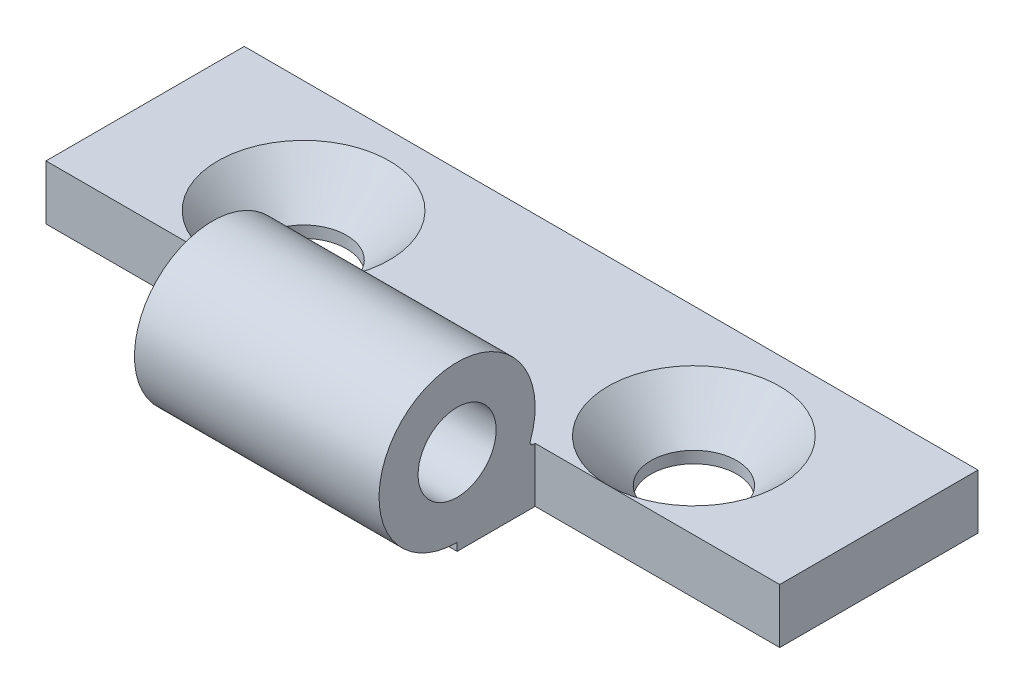
ISO-10303-21;
HEADER;
FILE_DESCRIPTION(('STEP AP214'),'2;1');
FILE_NAME('part.step','',(''),(''),'','','');
FILE_SCHEMA(('AUTOMOTIVE_DESIGN { 1 0 10303 214 1 1 1 1 }'));
ENDSEC;
DATA;
#1=APPLICATION_CONTEXT('core data for automotive mechanical design processes');
#2=APPLICATION_PROTOCOL_DEFINITION('international standard','automotive_design',2000,#1);
#3=PRODUCT_CONTEXT('',#1,'mechanical');
#4=PRODUCT('Part','Part','',(#3));
#5=PRODUCT_RELATED_PRODUCT_CATEGORY('part','',(#4));
#6=PRODUCT_DEFINITION_FORMATION('','',#4);
#7=PRODUCT_DEFINITION_CONTEXT('part definition',#1,'design');
#8=PRODUCT_DEFINITION('design','',#6,#7);
#9=PRODUCT_DEFINITION_SHAPE('','',#8);
#10=(LENGTH_UNIT() NAMED_UNIT(*) SI_UNIT(.MILLI.,.METRE.));
#11=(NAMED_UNIT(*) PLANE_ANGLE_UNIT() SI_UNIT($,.RADIAN.));
#12=(NAMED_UNIT(*) SI_UNIT($,.STERADIAN.) SOLID_ANGLE_UNIT());
#13=UNCERTAINTY_MEASURE_WITH_UNIT(LENGTH_MEASURE(1.E-05),#10,'distance_accuracy_value','');
#14=(GEOMETRIC_REPRESENTATION_CONTEXT(3) GLOBAL_UNCERTAINTY_ASSIGNED_CONTEXT((#13)) GLOBAL_UNIT_ASSIGNED_CONTEXT((#10,
#11,#12)) REPRESENTATION_CONTEXT('',''));
#15=CARTESIAN_POINT('',(0.,0.,0.));
#16=DIRECTION('',(0.,0.,1.));
#17=DIRECTION('',(1.,0.,0.));
#18=AXIS2_PLACEMENT_3D('',#15,#16,#17);
#19=CARTESIAN_POINT('',(61.0107976682072,3.5,-7.2));
#20=DIRECTION('',(0.,-1.,0.));
#21=DIRECTION('',(0.,0.,-1.));
#22=AXIS2_PLACEMENT_3D('',#19,#20,#21);
#23=PLANE('',#22);
#24=DIRECTION('',(0.,0.,1.));
#25=VECTOR('',#24,1.);
#26=CARTESIAN_POINT('',(20.3333333333333,3.5,-7.19999999999999));
#27=LINE('',#26,#25);
#28=CARTESIAN_POINT('',(20.3333333333333,3.49999999999999,5.5));
#29=VERTEX_POINT('',#28);
#30=CARTESIAN_POINT('',(20.3333333333333,3.49999999999999,5.62147563293982));
#31=VERTEX_POINT('',#30);
#32=EDGE_CURVE('E152',#29,#31,#27,.T.);
#33=ORIENTED_EDGE('',*,*,#32,.F.);
#34=DIRECTION('',(-1.,0.,0.));
#35=VECTOR('',#34,1.);
#36=CARTESIAN_POINT('',(61.0107976682072,3.49999999999999,5.5));
#37=LINE('',#36,#35);
#38=CARTESIAN_POINT('',(25.,3.5,5.5));
#39=VERTEX_POINT('',#38);
#40=EDGE_CURVE('E127',#39,#29,#37,.T.);
#41=ORIENTED_EDGE('',*,*,#40,.F.);
#42=CARTESIAN_POINT('',(25.,3.5,0.));
#43=DIRECTION('',(0.,1.,0.));
#44=DIRECTION('',(0.,0.,1.));
#45=AXIS2_PLACEMENT_3D('',#42,#43,#44);
#46=CIRCLE('',#45,5.5);
#47=EDGE_CURVE('E190',#39,#39,#46,.T.);
#48=ORIENTED_EDGE('',*,*,#47,.F.);
#49=CARTESIAN_POINT('',(36.0000000000007,3.5,5.5));
#50=VERTEX_POINT('',#49);
#51=EDGE_CURVE('E148',#50,#39,#37,.T.);
#52=ORIENTED_EDGE('',*,*,#51,.F.);
#53=DIRECTION('',(0.,0.,1.));
#54=VECTOR('',#53,1.);
#55=CARTESIAN_POINT('',(36.,3.5,-7.2));
#56=LINE('',#55,#54);
#57=CARTESIAN_POINT('',(36.,3.5,-7.2));
#58=VERTEX_POINT('',#57);
#59=EDGE_CURVE('E207',#58,#50,#56,.T.);
#60=ORIENTED_EDGE('',*,*,#59,.F.);
#61=DIRECTION('',(-1.,0.,0.));
#62=VECTOR('',#61,1.);
#63=CARTESIAN_POINT('',(61.0107976682072,3.5,-7.2));
#64=LINE('',#63,#62);
#65=CARTESIAN_POINT('',(-11.,3.5,-7.2));
#66=VERTEX_POINT('',#65);
#67=EDGE_CURVE('E216',#58,#66,#64,.T.);
#68=ORIENTED_EDGE('',*,*,#67,.T.);
#69=DIRECTION('',(0.,0.,-1.));
#70=VECTOR('',#69,1.);
#71=CARTESIAN_POINT('',(-11.,3.5,-7.2));
#72=LINE('',#71,#70);
#73=CARTESIAN_POINT('',(-11.,3.49999999999999,5.5));
#74=VERTEX_POINT('',#73);
#75=EDGE_CURVE('E205',#74,#66,#72,.T.);
#76=ORIENTED_EDGE('',*,*,#75,.F.);
#77=DIRECTION('',(-1.,0.,0.));
#78=VECTOR('',#77,1.);
#79=CARTESIAN_POINT('',(61.0107976682072,3.49999999999999,5.5));
#80=LINE('',#79,#78);
#81=CARTESIAN_POINT('',(0.,3.5,5.5));
#82=VERTEX_POINT('',#81);
#83=EDGE_CURVE('E66',#82,#74,#80,.T.);
#84=ORIENTED_EDGE('',*,*,#83,.F.);
#85=CARTESIAN_POINT('',(0.,3.5,0.));
#86=DIRECTION('',(0.,1.,0.));
#87=DIRECTION('',(0.,0.,1.));
#88=AXIS2_PLACEMENT_3D('',#85,#86,#87);
#89=CIRCLE('',#88,5.5);
#90=EDGE_CURVE('E181',#82,#82,#89,.T.);
#91=ORIENTED_EDGE('',*,*,#90,.F.);
#92=CARTESIAN_POINT('',(4.66666666666667,3.49999999999999,5.5));
#93=VERTEX_POINT('',#92);
#94=EDGE_CURVE('E168',#93,#82,#80,.T.);
#95=ORIENTED_EDGE('',*,*,#94,.F.);
#96=DIRECTION('',(0.,0.,-1.));
#97=VECTOR('',#96,1.);
#98=CARTESIAN_POINT('',(4.66666666666667,3.5,-7.2));
#99=LINE('',#98,#97);
#100=CARTESIAN_POINT('',(4.66666666666667,3.49999999999999,5.62147563293982));
#101=VERTEX_POINT('',#100);
#102=EDGE_CURVE('E172',#101,#93,#99,.T.);
#103=ORIENTED_EDGE('',*,*,#102,.F.);
#104=DIRECTION('',(-1.,0.,0.));
#105=VECTOR('',#104,1.);
#106=CARTESIAN_POINT('',(61.0107976682072,3.49999999999999,5.62147563293982));
#107=LINE('',#106,#105);
#108=EDGE_CURVE('E214',#31,#101,#107,.T.);
#109=ORIENTED_EDGE('',*,*,#108,.F.);
#110=EDGE_LOOP('',(#33,#41,#48,#52,#60,#68,#76,#84,#91,#95,#103,#109));
#111=FACE_BOUND('',#110,.T.);
#112=ADVANCED_FACE('F41',(#111),#23,.F.);
#113=CARTESIAN_POINT('',(61.0107976682072,0.,-7.2));
#114=DIRECTION('',(0.,1.,0.));
#115=DIRECTION('',(0.,0.,1.));
#116=AXIS2_PLACEMENT_3D('',#113,#114,#115);
#117=PLANE('',#116);
#118=CARTESIAN_POINT('',(0.,0.,0.));
#119=DIRECTION('',(0.,1.,0.));
#120=DIRECTION('',(0.,0.,1.));
#121=AXIS2_PLACEMENT_3D('',#118,#119,#120);
#122=CIRCLE('',#121,2.75);
#123=CARTESIAN_POINT('',(0.,0.,2.75));
#124=VERTEX_POINT('',#123);
#125=EDGE_CURVE('E187',#124,#124,#122,.T.);
#126=ORIENTED_EDGE('',*,*,#125,.T.);
#127=EDGE_LOOP('',(#126));
#128=FACE_BOUND('',#127,.T.);
#129=CARTESIAN_POINT('',(25.,0.,0.));
#130=DIRECTION('',(0.,1.,0.));
#131=DIRECTION('',(0.,0.,1.));
#132=AXIS2_PLACEMENT_3D('',#129,#130,#131);
#133=CIRCLE('',#132,2.75);
#134=CARTESIAN_POINT('',(25.,0.,2.75));
#135=VERTEX_POINT('',#134);
#136=EDGE_CURVE('E196',#135,#135,#133,.T.);
#137=ORIENTED_EDGE('',*,*,#136,.T.);
#138=EDGE_LOOP('',(#137));
#139=FACE_BOUND('',#138,.T.);
#140=DIRECTION('',(0.,0.,1.));
#141=VECTOR('',#140,1.);
#142=CARTESIAN_POINT('',(20.3333333333333,0.,5.5));
#143=LINE('',#142,#141);
#144=CARTESIAN_POINT('',(20.3333333333333,0.,5.5));
#145=VERTEX_POINT('',#144);
#146=CARTESIAN_POINT('',(20.3333333333333,0.,10.5));
#147=VERTEX_POINT('',#146);
#148=EDGE_CURVE('E133',#145,#147,#143,.T.);
#149=ORIENTED_EDGE('',*,*,#148,.T.);
#150=DIRECTION('',(-1.,0.,0.));
#151=VECTOR('',#150,1.);
#152=CARTESIAN_POINT('',(61.0107976682072,0.,10.5));
#153=LINE('',#152,#151);
#154=CARTESIAN_POINT('',(4.66666666666667,0.,10.5));
#155=VERTEX_POINT('',#154);
#156=EDGE_CURVE('E221',#147,#155,#153,.T.);
#157=ORIENTED_EDGE('',*,*,#156,.T.);
#158=DIRECTION('',(0.,0.,-1.));
#159=VECTOR('',#158,1.);
#160=CARTESIAN_POINT('',(4.66666666666667,0.,5.5));
#161=LINE('',#160,#159);
#162=CARTESIAN_POINT('',(4.66666666666667,0.,5.5));
#163=VERTEX_POINT('',#162);
#164=EDGE_CURVE('E157',#155,#163,#161,.T.);
#165=ORIENTED_EDGE('',*,*,#164,.T.);
#166=DIRECTION('',(-1.,0.,0.));
#167=VECTOR('',#166,1.);
#168=CARTESIAN_POINT('',(-11.,0.,5.5));
#169=LINE('',#168,#167);
#170=CARTESIAN_POINT('',(-11.,0.,5.5));
#171=VERTEX_POINT('',#170);
#172=EDGE_CURVE('E160',#163,#171,#169,.T.);
#173=ORIENTED_EDGE('',*,*,#172,.T.);
#174=DIRECTION('',(0.,0.,1.));
#175=VECTOR('',#174,1.);
#176=CARTESIAN_POINT('',(-11.,0.,-7.2));
#177=LINE('',#176,#175);
#178=CARTESIAN_POINT('',(-11.,0.,-7.2));
#179=VERTEX_POINT('',#178);
#180=EDGE_CURVE('E199',#179,#171,#177,.T.);
#181=ORIENTED_EDGE('',*,*,#180,.F.);
#182=DIRECTION('',(-1.,0.,0.));
#183=VECTOR('',#182,1.);
#184=CARTESIAN_POINT('',(61.0107976682072,0.,-7.2));
#185=LINE('',#184,#183);
#186=CARTESIAN_POINT('',(36.,0.,-7.2));
#187=VERTEX_POINT('',#186);
#188=EDGE_CURVE('E219',#187,#179,#185,.T.);
#189=ORIENTED_EDGE('',*,*,#188,.F.);
#190=DIRECTION('',(0.,0.,-1.));
#191=VECTOR('',#190,1.);
#192=CARTESIAN_POINT('',(36.,0.,-7.2));
#193=LINE('',#192,#191);
#194=CARTESIAN_POINT('',(36.,0.,5.5));
#195=VERTEX_POINT('',#194);
#196=EDGE_CURVE('E143',#195,#187,#193,.T.);
#197=ORIENTED_EDGE('',*,*,#196,.F.);
#198=DIRECTION('',(-1.,0.,0.));
#199=VECTOR('',#198,1.);
#200=CARTESIAN_POINT('',(20.3333333333333,0.,5.5));
#201=LINE('',#200,#199);
#202=EDGE_CURVE('E58',#195,#145,#201,.T.);
#203=ORIENTED_EDGE('',*,*,#202,.T.);
#204=EDGE_LOOP('',(#149,#157,#165,#173,#181,#189,#197,#203));
#205=FACE_BOUND('',#204,.T.);
#206=ADVANCED_FACE('F141',(#128,#139,#205),#117,.F.);
#207=CARTESIAN_POINT('',(61.0107976682072,0.499999999999998,10.5));
#208=DIRECTION('',(0.,0.,-1.));
#209=DIRECTION('',(-1.,0.,0.));
#210=AXIS2_PLACEMENT_3D('',#207,#208,#209);
#211=PLANE('',#210);
#212=DIRECTION('',(0.,-1.,0.));
#213=VECTOR('',#212,1.);
#214=CARTESIAN_POINT('',(20.3333333333333,0.499999999999998,10.5));
#215=LINE('',#214,#213);
#216=CARTESIAN_POINT('',(20.3333333333333,0.499999999999999,10.5));
#217=VERTEX_POINT('',#216);
#218=EDGE_CURVE('E136',#217,#147,#215,.T.);
#219=ORIENTED_EDGE('',*,*,#218,.F.);
#220=DIRECTION('',(-1.,0.,0.));
#221=VECTOR('',#220,1.);
#222=CARTESIAN_POINT('',(61.0107976682072,0.499999999999999,10.5));
#223=LINE('',#222,#221);
#224=CARTESIAN_POINT('',(4.66666666666667,0.499999999999999,10.5));
#225=VERTEX_POINT('',#224);
#226=EDGE_CURVE('E50',#217,#225,#223,.T.);
#227=ORIENTED_EDGE('',*,*,#226,.T.);
#228=DIRECTION('',(0.,1.,0.));
#229=VECTOR('',#228,1.);
#230=CARTESIAN_POINT('',(4.66666666666667,0.499999999999998,10.5));
#231=LINE('',#230,#229);
#232=EDGE_CURVE('E177',#155,#225,#231,.T.);
#233=ORIENTED_EDGE('',*,*,#232,.F.);
#234=ORIENTED_EDGE('',*,*,#156,.F.);
#235=EDGE_LOOP('',(#219,#227,#233,#234));
#236=FACE_BOUND('',#235,.T.);
#237=ADVANCED_FACE('F256',(#236),#211,.F.);
#238=CARTESIAN_POINT('',(61.0107976682072,5.5,10.5));
#239=DIRECTION('',(-1.,0.,0.));
#240=DIRECTION('',(0.,0.,1.));
#241=AXIS2_PLACEMENT_3D('',#238,#239,#240);
#242=CYLINDRICAL_SURFACE('',#241,5.);
#243=CARTESIAN_POINT('',(20.3333333333333,5.5,10.5));
#244=DIRECTION('',(1.,0.,0.));
#245=DIRECTION('',(0.,0.,-1.));
#246=AXIS2_PLACEMENT_3D('',#243,#244,#245);
#247=CIRCLE('',#246,5.);
#248=CARTESIAN_POINT('',(20.3333333333333,3.76923076923076,5.80911118551905));
#249=VERTEX_POINT('',#248);
#250=EDGE_CURVE('E153',#249,#217,#247,.T.);
#251=ORIENTED_EDGE('',*,*,#250,.F.);
#252=DIRECTION('',(-1.,0.,0.));
#253=VECTOR('',#252,1.);
#254=CARTESIAN_POINT('',(61.0107976682072,3.76923076923076,5.80911118551906));
#255=LINE('',#254,#253);
#256=CARTESIAN_POINT('',(4.66666666666667,3.76923076923076,5.80911118551905));
#257=VERTEX_POINT('',#256);
#258=EDGE_CURVE('E11',#249,#257,#255,.T.);
#259=ORIENTED_EDGE('',*,*,#258,.T.);
#260=CARTESIAN_POINT('',(4.66666666666667,5.5,10.5));
#261=DIRECTION('',(-1.,0.,0.));
#262=DIRECTION('',(0.,0.,1.));
#263=AXIS2_PLACEMENT_3D('',#260,#261,#262);
#264=CIRCLE('',#263,5.);
#265=EDGE_CURVE('E174',#225,#257,#264,.T.);
#266=ORIENTED_EDGE('',*,*,#265,.F.);
#267=ORIENTED_EDGE('',*,*,#226,.F.);
#268=EDGE_LOOP('',(#251,#259,#266,#267));
#269=FACE_BOUND('',#268,.T.);
#270=ADVANCED_FACE('F270',(#269),#242,.T.);
#271=CARTESIAN_POINT('',(61.0107976682072,3.69999999999999,5.62147563293982));
#272=DIRECTION('',(-1.,0.,0.));
#273=DIRECTION('',(0.,0.,1.));
#274=AXIS2_PLACEMENT_3D('',#271,#272,#273);
#275=CYLINDRICAL_SURFACE('',#274,0.2);
#276=CARTESIAN_POINT('',(20.3333333333333,3.69999999999999,5.62147563293982));
#277=DIRECTION('',(1.,0.,0.));
#278=DIRECTION('',(0.,0.,-1.));
#279=AXIS2_PLACEMENT_3D('',#276,#277,#278);
#280=CIRCLE('',#279,0.2);
#281=EDGE_CURVE('E149',#31,#249,#280,.F.);
#282=ORIENTED_EDGE('',*,*,#281,.F.);
#283=ORIENTED_EDGE('',*,*,#108,.T.);
#284=CARTESIAN_POINT('',(4.66666666666667,3.69999999999999,5.62147563293982));
#285=DIRECTION('',(-1.,0.,0.));
#286=DIRECTION('',(0.,0.,1.));
#287=AXIS2_PLACEMENT_3D('',#284,#285,#286);
#288=CIRCLE('',#287,0.2);
#289=EDGE_CURVE('E169',#257,#101,#288,.F.);
#290=ORIENTED_EDGE('',*,*,#289,.F.);
#291=ORIENTED_EDGE('',*,*,#258,.F.);
#292=EDGE_LOOP('',(#282,#283,#290,#291));
#293=FACE_BOUND('',#292,.T.);
#294=ADVANCED_FACE('F43',(#293),#275,.F.);
#295=CARTESIAN_POINT('',(61.0107976682072,5.5,10.5));
#296=DIRECTION('',(-1.,0.,0.));
#297=DIRECTION('',(0.,0.,1.));
#298=AXIS2_PLACEMENT_3D('',#295,#296,#297);
#299=CYLINDRICAL_SURFACE('',#298,2.5);
#300=CARTESIAN_POINT('',(4.66666666666667,5.5,10.5));
#301=DIRECTION('',(-1.,0.,0.));
#302=DIRECTION('',(0.,0.,1.));
#303=AXIS2_PLACEMENT_3D('',#300,#301,#302);
#304=CIRCLE('',#303,2.5);
#305=CARTESIAN_POINT('',(4.66666666666667,5.5,13.));
#306=VERTEX_POINT('',#305);
#307=EDGE_CURVE('E173',#306,#306,#304,.T.);
#308=ORIENTED_EDGE('',*,*,#307,.T.);
#309=EDGE_LOOP('',(#308));
#310=FACE_BOUND('',#309,.T.);
#311=CARTESIAN_POINT('',(20.3333333333333,5.5,10.5));
#312=DIRECTION('',(1.,0.,0.));
#313=DIRECTION('',(0.,0.,-1.));
#314=AXIS2_PLACEMENT_3D('',#311,#312,#313);
#315=CIRCLE('',#314,2.5);
#316=CARTESIAN_POINT('',(20.3333333333333,5.5,8.));
#317=VERTEX_POINT('',#316);
#318=EDGE_CURVE('E45',#317,#317,#315,.T.);
#319=ORIENTED_EDGE('',*,*,#318,.T.);
#320=EDGE_LOOP('',(#319));
#321=FACE_BOUND('',#320,.T.);
#322=ADVANCED_FACE('F261',(#310,#321),#299,.F.);
#323=CARTESIAN_POINT('',(36.,0.,0.));
#324=DIRECTION('',(1.,0.,0.));
#325=DIRECTION('',(0.,0.,-1.));
#326=AXIS2_PLACEMENT_3D('',#323,#324,#325);
#327=PLANE('',#326);
#328=ORIENTED_EDGE('',*,*,#59,.T.);
#329=DIRECTION('',(0.,-1.,0.));
#330=VECTOR('',#329,1.);
#331=CARTESIAN_POINT('',(36.0000000000007,10.5,5.5));
#332=LINE('',#331,#330);
#333=EDGE_CURVE('E130',#50,#195,#332,.T.);
#334=ORIENTED_EDGE('',*,*,#333,.T.);
#335=ORIENTED_EDGE('',*,*,#196,.T.);
#336=DIRECTION('',(0.,1.,0.));
#337=VECTOR('',#336,1.);
#338=CARTESIAN_POINT('',(36.,0.,-7.2));
#339=LINE('',#338,#337);
#340=EDGE_CURVE('E210',#187,#58,#339,.T.);
#341=ORIENTED_EDGE('',*,*,#340,.T.);
#342=EDGE_LOOP('',(#328,#334,#335,#341));
#343=FACE_BOUND('',#342,.T.);
#344=ADVANCED_FACE('F299',(#343),#327,.T.);
#345=CARTESIAN_POINT('',(-11.,0.,0.));
#346=DIRECTION('',(1.,0.,0.));
#347=DIRECTION('',(0.,0.,-1.));
#348=AXIS2_PLACEMENT_3D('',#345,#346,#347);
#349=PLANE('',#348);
#350=DIRECTION('',(0.,-1.,0.));
#351=VECTOR('',#350,1.);
#352=CARTESIAN_POINT('',(-11.,10.5,5.5));
#353=LINE('',#352,#351);
#354=EDGE_CURVE('E163',#74,#171,#353,.T.);
#355=ORIENTED_EDGE('',*,*,#354,.F.);
#356=ORIENTED_EDGE('',*,*,#75,.T.);
#357=DIRECTION('',(0.,-1.,0.));
#358=VECTOR('',#357,1.);
#359=CARTESIAN_POINT('',(-11.,0.,-7.2));
#360=LINE('',#359,#358);
#361=EDGE_CURVE('E202',#66,#179,#360,.T.);
#362=ORIENTED_EDGE('',*,*,#361,.T.);
#363=ORIENTED_EDGE('',*,*,#180,.T.);
#364=EDGE_LOOP('',(#355,#356,#362,#363));
#365=FACE_BOUND('',#364,.T.);
#366=ADVANCED_FACE('F266',(#365),#349,.F.);
#367=CARTESIAN_POINT('',(61.0107976682072,0.,-7.2));
#368=DIRECTION('',(0.,0.,1.));
#369=DIRECTION('',(1.,0.,0.));
#370=AXIS2_PLACEMENT_3D('',#367,#368,#369);
#371=PLANE('',#370);
#372=ORIENTED_EDGE('',*,*,#340,.F.);
#373=ORIENTED_EDGE('',*,*,#188,.T.);
#374=ORIENTED_EDGE('',*,*,#361,.F.);
#375=ORIENTED_EDGE('',*,*,#67,.F.);
#376=EDGE_LOOP('',(#372,#373,#374,#375));
#377=FACE_BOUND('',#376,.T.);
#378=ADVANCED_FACE('F263',(#377),#371,.F.);
#379=CARTESIAN_POINT('',(25.,3.5,0.));
#380=DIRECTION('',(0.,1.,0.));
#381=DIRECTION('',(0.,0.,1.));
#382=AXIS2_PLACEMENT_3D('',#379,#380,#381);
#383=CYLINDRICAL_SURFACE('',#382,2.75);
#384=ORIENTED_EDGE('',*,*,#136,.F.);
#385=EDGE_LOOP('',(#384));
#386=FACE_BOUND('',#385,.T.);
#387=CARTESIAN_POINT('',(25.,0.749999999999997,0.));
#388=DIRECTION('',(0.,1.,0.));
#389=DIRECTION('',(0.,0.,1.));
#390=AXIS2_PLACEMENT_3D('',#387,#388,#389);
#391=CIRCLE('',#390,2.75);
#392=CARTESIAN_POINT('',(25.,0.749999999999996,2.75));
#393=VERTEX_POINT('',#392);
#394=EDGE_CURVE('E193',#393,#393,#391,.T.);
#395=ORIENTED_EDGE('',*,*,#394,.T.);
#396=EDGE_LOOP('',(#395));
#397=FACE_BOUND('',#396,.T.);
#398=ADVANCED_FACE('F265',(#386,#397),#383,.F.);
#399=CARTESIAN_POINT('',(25.,3.5,0.));
#400=DIRECTION('',(0.,1.,0.));
#401=DIRECTION('',(0.,0.,1.));
#402=AXIS2_PLACEMENT_3D('',#399,#400,#401);
#403=CONICAL_SURFACE('',#402,5.5,0.785398163397448);
#404=ORIENTED_EDGE('',*,*,#394,.F.);
#405=EDGE_LOOP('',(#404));
#406=FACE_BOUND('',#405,.T.);
#407=ORIENTED_EDGE('',*,*,#47,.T.);
#408=EDGE_LOOP('',(#407));
#409=FACE_BOUND('',#408,.T.);
#410=ADVANCED_FACE('F247',(#406,#409),#403,.F.);
#411=CARTESIAN_POINT('',(0.,3.5,0.));
#412=DIRECTION('',(0.,1.,0.));
#413=DIRECTION('',(0.,0.,1.));
#414=AXIS2_PLACEMENT_3D('',#411,#412,#413);
#415=CYLINDRICAL_SURFACE('',#414,2.75);
#416=ORIENTED_EDGE('',*,*,#125,.F.);
#417=EDGE_LOOP('',(#416));
#418=FACE_BOUND('',#417,.T.);
#419=CARTESIAN_POINT('',(0.,0.749999999999997,0.));
#420=DIRECTION('',(0.,1.,0.));
#421=DIRECTION('',(0.,0.,1.));
#422=AXIS2_PLACEMENT_3D('',#419,#420,#421);
#423=CIRCLE('',#422,2.75);
#424=CARTESIAN_POINT('',(0.,0.749999999999996,2.75));
#425=VERTEX_POINT('',#424);
#426=EDGE_CURVE('E184',#425,#425,#423,.T.);
#427=ORIENTED_EDGE('',*,*,#426,.T.);
#428=EDGE_LOOP('',(#427));
#429=FACE_BOUND('',#428,.T.);
#430=ADVANCED_FACE('F238',(#418,#429),#415,.F.);
#431=CARTESIAN_POINT('',(0.,3.5,0.));
#432=DIRECTION('',(0.,1.,0.));
#433=DIRECTION('',(0.,0.,1.));
#434=AXIS2_PLACEMENT_3D('',#431,#432,#433);
#435=CONICAL_SURFACE('',#434,5.5,0.785398163397449);
#436=ORIENTED_EDGE('',*,*,#426,.F.);
#437=EDGE_LOOP('',(#436));
#438=FACE_BOUND('',#437,.T.);
#439=ORIENTED_EDGE('',*,*,#90,.T.);
#440=EDGE_LOOP('',(#439));
#441=FACE_BOUND('',#440,.T.);
#442=ADVANCED_FACE('F235',(#438,#441),#435,.F.);
#443=CARTESIAN_POINT('',(4.66666666666667,10.5,5.5));
#444=DIRECTION('',(-1.,0.,0.));
#445=DIRECTION('',(0.,0.,1.));
#446=AXIS2_PLACEMENT_3D('',#443,#444,#445);
#447=PLANE('',#446);
#448=ORIENTED_EDGE('',*,*,#307,.F.);
#449=EDGE_LOOP('',(#448));
#450=FACE_BOUND('',#449,.T.);
#451=ORIENTED_EDGE('',*,*,#232,.T.);
#452=ORIENTED_EDGE('',*,*,#265,.T.);
#453=ORIENTED_EDGE('',*,*,#289,.T.);
#454=ORIENTED_EDGE('',*,*,#102,.T.);
#455=DIRECTION('',(0.,-1.,0.));
#456=VECTOR('',#455,1.);
#457=CARTESIAN_POINT('',(4.66666666666667,10.5,5.5));
#458=LINE('',#457,#456);
#459=EDGE_CURVE('E165',#93,#163,#458,.T.);
#460=ORIENTED_EDGE('',*,*,#459,.T.);
#461=ORIENTED_EDGE('',*,*,#164,.F.);
#462=EDGE_LOOP('',(#451,#452,#453,#454,#460,#461));
#463=FACE_BOUND('',#462,.T.);
#464=ADVANCED_FACE('F237',(#450,#463),#447,.T.);
#465=CARTESIAN_POINT('',(-11.,10.5,5.5));
#466=DIRECTION('',(0.,0.,1.));
#467=DIRECTION('',(1.,0.,0.));
#468=AXIS2_PLACEMENT_3D('',#465,#466,#467);
#469=PLANE('',#468);
#470=ORIENTED_EDGE('',*,*,#94,.T.);
#471=ORIENTED_EDGE('',*,*,#83,.T.);
#472=ORIENTED_EDGE('',*,*,#354,.T.);
#473=ORIENTED_EDGE('',*,*,#172,.F.);
#474=ORIENTED_EDGE('',*,*,#459,.F.);
#475=EDGE_LOOP('',(#470,#471,#472,#473,#474));
#476=FACE_BOUND('',#475,.T.);
#477=ADVANCED_FACE('F228',(#476),#469,.T.);
#478=CARTESIAN_POINT('',(20.3333333333333,10.5,5.5));
#479=DIRECTION('',(1.,0.,0.));
#480=DIRECTION('',(0.,0.,-1.));
#481=AXIS2_PLACEMENT_3D('',#478,#479,#480);
#482=PLANE('',#481);
#483=ORIENTED_EDGE('',*,*,#318,.F.);
#484=EDGE_LOOP('',(#483));
#485=FACE_BOUND('',#484,.T.);
#486=ORIENTED_EDGE('',*,*,#218,.T.);
#487=ORIENTED_EDGE('',*,*,#148,.F.);
#488=DIRECTION('',(0.,-1.,0.));
#489=VECTOR('',#488,1.);
#490=CARTESIAN_POINT('',(20.3333333333333,10.5,5.5));
#491=LINE('',#490,#489);
#492=EDGE_CURVE('E123',#29,#145,#491,.T.);
#493=ORIENTED_EDGE('',*,*,#492,.F.);
#494=ORIENTED_EDGE('',*,*,#32,.T.);
#495=ORIENTED_EDGE('',*,*,#281,.T.);
#496=ORIENTED_EDGE('',*,*,#250,.T.);
#497=EDGE_LOOP('',(#486,#487,#493,#494,#495,#496));
#498=FACE_BOUND('',#497,.T.);
#499=ADVANCED_FACE('F134',(#485,#498),#482,.T.);
#500=CARTESIAN_POINT('',(20.3333333333333,10.5,5.5));
#501=DIRECTION('',(0.,0.,1.));
#502=DIRECTION('',(1.,0.,0.));
#503=AXIS2_PLACEMENT_3D('',#500,#501,#502);
#504=PLANE('',#503);
#505=ORIENTED_EDGE('',*,*,#51,.T.);
#506=ORIENTED_EDGE('',*,*,#40,.T.);
#507=ORIENTED_EDGE('',*,*,#492,.T.);
#508=ORIENTED_EDGE('',*,*,#202,.F.);
#509=ORIENTED_EDGE('',*,*,#333,.F.);
#510=EDGE_LOOP('',(#505,#506,#507,#508,#509));
#511=FACE_BOUND('',#510,.T.);
#512=ADVANCED_FACE('F125',(#511),#504,.T.);
#513=CLOSED_SHELL('',(#112,#206,#237,#270,#294,#322,#344,#366,#378,#398,#410,#430,#442,#464,
#477,#499,#512));
#514=MANIFOLD_SOLID_BREP('B2',#513);
#515=ADVANCED_BREP_SHAPE_REPRESENTATION('',(#18,#514),#14);
#516=SHAPE_DEFINITION_REPRESENTATION(#9,#515);
ENDSEC;
END-ISO-10303-21;
